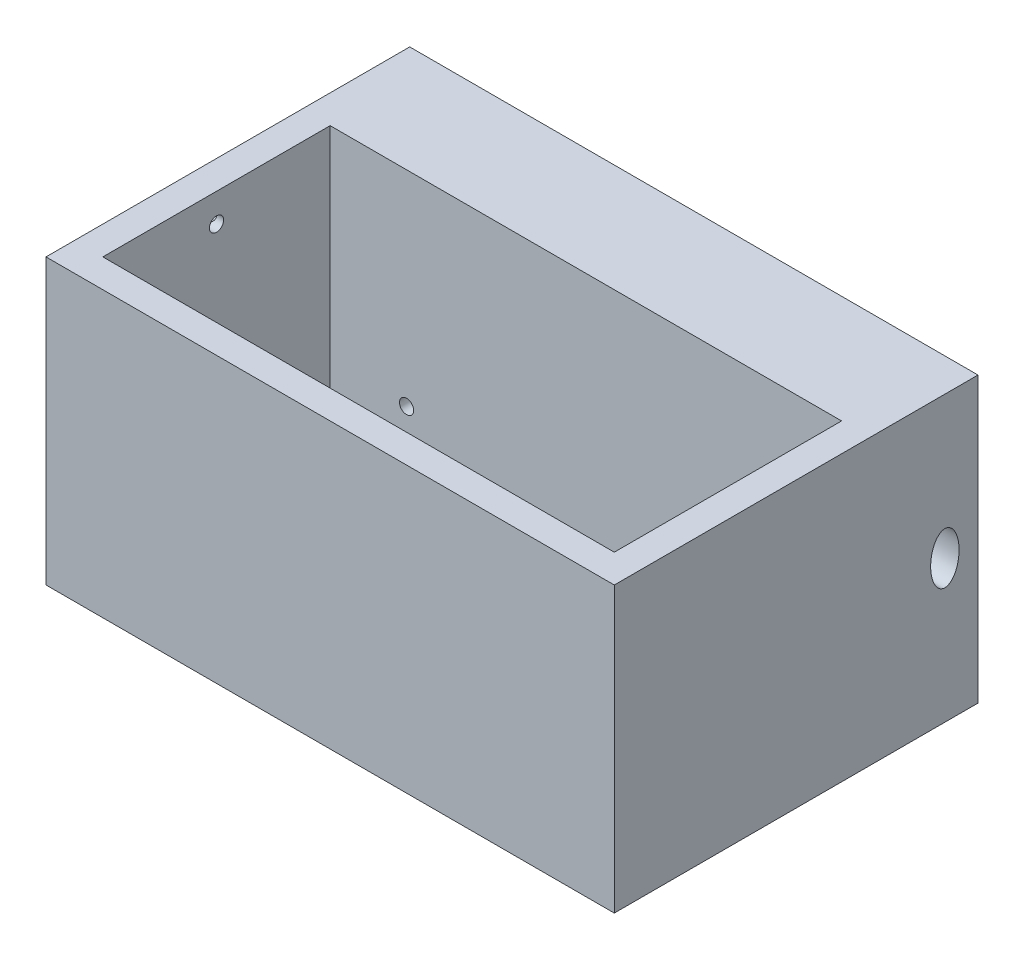
ISO-10303-21;
HEADER;
FILE_DESCRIPTION(('STEP AP214'),'2;1');
FILE_NAME('part.step','',(''),(''),'','','');
FILE_SCHEMA(('AUTOMOTIVE_DESIGN { 1 0 10303 214 1 1 1 1 }'));
ENDSEC;
DATA;
#1=APPLICATION_CONTEXT('core data for automotive mechanical design processes');
#2=APPLICATION_PROTOCOL_DEFINITION('international standard','automotive_design',2000,#1);
#3=PRODUCT_CONTEXT('',#1,'mechanical');
#4=PRODUCT('Part','Part','',(#3));
#5=PRODUCT_RELATED_PRODUCT_CATEGORY('part','',(#4));
#6=PRODUCT_DEFINITION_FORMATION('','',#4);
#7=PRODUCT_DEFINITION_CONTEXT('part definition',#1,'design');
#8=PRODUCT_DEFINITION('design','',#6,#7);
#9=PRODUCT_DEFINITION_SHAPE('','',#8);
#10=(LENGTH_UNIT() NAMED_UNIT(*) SI_UNIT(.MILLI.,.METRE.));
#11=(NAMED_UNIT(*) PLANE_ANGLE_UNIT() SI_UNIT($,.RADIAN.));
#12=(NAMED_UNIT(*) SI_UNIT($,.STERADIAN.) SOLID_ANGLE_UNIT());
#13=UNCERTAINTY_MEASURE_WITH_UNIT(LENGTH_MEASURE(1.E-05),#10,'distance_accuracy_value','');
#14=(GEOMETRIC_REPRESENTATION_CONTEXT(3) GLOBAL_UNCERTAINTY_ASSIGNED_CONTEXT((#13)) GLOBAL_UNIT_ASSIGNED_CONTEXT((#10,
#11,#12)) REPRESENTATION_CONTEXT('',''));
#15=CARTESIAN_POINT('',(0.,0.,0.));
#16=DIRECTION('',(0.,0.,1.));
#17=DIRECTION('',(1.,0.,0.));
#18=AXIS2_PLACEMENT_3D('',#15,#16,#17);
#19=CARTESIAN_POINT('',(-31.5504524503073,8.33548406117359,-16.4644660940673));
#20=DIRECTION('',(0.,0.,-1.));
#21=DIRECTION('',(-1.,0.,0.));
#22=AXIS2_PLACEMENT_3D('',#19,#20,#21);
#23=CYLINDRICAL_SURFACE('',#22,1.25);
#24=CARTESIAN_POINT('',(-31.5504524503073,8.33548406117359,-20.));
#25=DIRECTION('',(0.,0.,1.));
#26=DIRECTION('',(1.,0.,0.));
#27=AXIS2_PLACEMENT_3D('',#24,#25,#26);
#28=CIRCLE('',#27,1.25);
#29=CARTESIAN_POINT('',(-30.3004524503073,8.33548406117359,-20.));
#30=VERTEX_POINT('',#29);
#31=EDGE_CURVE('E193',#30,#30,#28,.F.);
#32=ORIENTED_EDGE('',*,*,#31,.F.);
#33=EDGE_LOOP('',(#32));
#34=FACE_BOUND('',#33,.T.);
#35=CARTESIAN_POINT('',(-31.5504524503073,8.33548406117359,-22.5));
#36=DIRECTION('',(0.,0.,-1.));
#37=DIRECTION('',(-1.,0.,0.));
#38=AXIS2_PLACEMENT_3D('',#35,#36,#37);
#39=CIRCLE('',#38,1.25);
#40=CARTESIAN_POINT('',(-32.8004524503073,8.33548406117359,-22.5));
#41=VERTEX_POINT('',#40);
#42=EDGE_CURVE('E191',#41,#41,#39,.F.);
#43=ORIENTED_EDGE('',*,*,#42,.F.);
#44=EDGE_LOOP('',(#43));
#45=FACE_BOUND('',#44,.T.);
#46=ADVANCED_FACE('F39',(#34,#45),#23,.F.);
#47=CARTESIAN_POINT('',(48.975,45.,22.5));
#48=DIRECTION('',(-1.,0.,0.));
#49=DIRECTION('',(0.,0.,1.));
#50=AXIS2_PLACEMENT_3D('',#47,#48,#49);
#51=CYLINDRICAL_SURFACE('',#50,1.25);
#52=CARTESIAN_POINT('',(1.24999999999999,45.,22.5));
#53=DIRECTION('',(-0.707106781186547,0.707106781186547,0.));
#54=DIRECTION('',(-0.707106781186547,-0.707106781186547,0.));
#55=AXIS2_PLACEMENT_3D('',#52,#53,#54);
#56=ELLIPSE('',#55,1.76776695296637,1.25);
#57=CARTESIAN_POINT('',(1.24999999999999,45.,21.25));
#58=VERTEX_POINT('',#57);
#59=CARTESIAN_POINT('',(1.24999999999999,45.,23.75));
#60=VERTEX_POINT('',#59);
#61=EDGE_CURVE('E11',#58,#60,#56,.F.);
#62=ORIENTED_EDGE('',*,*,#61,.F.);
#63=CARTESIAN_POINT('',(1.24999999999999,45.,22.5));
#64=DIRECTION('',(-0.707106781186547,-0.707106781186547,0.));
#65=DIRECTION('',(-0.707106781186547,0.707106781186547,0.));
#66=AXIS2_PLACEMENT_3D('',#63,#64,#65);
#67=ELLIPSE('',#66,1.76776695296637,1.25);
#68=EDGE_CURVE('E55',#60,#58,#67,.F.);
#69=ORIENTED_EDGE('',*,*,#68,.F.);
#70=EDGE_LOOP('',(#62,#69));
#71=FACE_BOUND('',#70,.T.);
#72=CARTESIAN_POINT('',(47.5,45.,22.5));
#73=DIRECTION('',(-0.707106781186547,0.,0.707106781186548));
#74=DIRECTION('',(0.707106781186548,0.,0.707106781186547));
#75=AXIS2_PLACEMENT_3D('',#72,#73,#74);
#76=ELLIPSE('',#75,1.76776695296637,1.25);
#77=CARTESIAN_POINT('',(48.75,45.,23.75));
#78=VERTEX_POINT('',#77);
#79=EDGE_CURVE('E273',#78,#78,#76,.T.);
#80=ORIENTED_EDGE('',*,*,#79,.F.);
#81=EDGE_LOOP('',(#80));
#82=FACE_BOUND('',#81,.T.);
#83=ADVANCED_FACE('F329',(#71,#82),#51,.F.);
#84=CARTESIAN_POINT('',(0.,50.,0.));
#85=DIRECTION('',(0.,-1.,0.));
#86=DIRECTION('',(0.,0.,-1.));
#87=AXIS2_PLACEMENT_3D('',#84,#85,#86);
#88=PLANE('',#87);
#89=DIRECTION('',(0.,0.,-1.));
#90=VECTOR('',#89,1.);
#91=CARTESIAN_POINT('',(50.,50.,25.));
#92=LINE('',#91,#90);
#93=CARTESIAN_POINT('',(50.,50.,25.));
#94=VERTEX_POINT('',#93);
#95=CARTESIAN_POINT('',(50.,50.,-39.));
#96=VERTEX_POINT('',#95);
#97=EDGE_CURVE('E305',#94,#96,#92,.T.);
#98=ORIENTED_EDGE('',*,*,#97,.T.);
#99=DIRECTION('',(1.,0.,0.));
#100=VECTOR('',#99,1.);
#101=CARTESIAN_POINT('',(0.,50.,-39.));
#102=LINE('',#101,#100);
#103=CARTESIAN_POINT('',(-50.,50.,-39.));
#104=VERTEX_POINT('',#103);
#105=EDGE_CURVE('E228',#104,#96,#102,.T.);
#106=ORIENTED_EDGE('',*,*,#105,.F.);
#107=DIRECTION('',(0.,0.,1.));
#108=VECTOR('',#107,1.);
#109=CARTESIAN_POINT('',(-50.,50.,25.));
#110=LINE('',#109,#108);
#111=CARTESIAN_POINT('',(-50.,50.,25.));
#112=VERTEX_POINT('',#111);
#113=EDGE_CURVE('E307',#104,#112,#110,.T.);
#114=ORIENTED_EDGE('',*,*,#113,.T.);
#115=DIRECTION('',(1.,0.,0.));
#116=VECTOR('',#115,1.);
#117=CARTESIAN_POINT('',(-50.,50.,25.));
#118=LINE('',#117,#116);
#119=EDGE_CURVE('E310',#112,#94,#118,.T.);
#120=ORIENTED_EDGE('',*,*,#119,.T.);
#121=EDGE_LOOP('',(#98,#106,#114,#120));
#122=FACE_BOUND('',#121,.T.);
#123=DIRECTION('',(0.,0.,-1.));
#124=VECTOR('',#123,1.);
#125=CARTESIAN_POINT('',(45.,50.,0.));
#126=LINE('',#125,#124);
#127=CARTESIAN_POINT('',(45.,50.,20.));
#128=VERTEX_POINT('',#127);
#129=CARTESIAN_POINT('',(45.,50.,-20.));
#130=VERTEX_POINT('',#129);
#131=EDGE_CURVE('E298',#128,#130,#126,.T.);
#132=ORIENTED_EDGE('',*,*,#131,.F.);
#133=DIRECTION('',(1.,0.,0.));
#134=VECTOR('',#133,1.);
#135=CARTESIAN_POINT('',(0.,50.,20.));
#136=LINE('',#135,#134);
#137=CARTESIAN_POINT('',(-45.,50.,20.));
#138=VERTEX_POINT('',#137);
#139=EDGE_CURVE('E289',#138,#128,#136,.T.);
#140=ORIENTED_EDGE('',*,*,#139,.F.);
#141=DIRECTION('',(0.,0.,1.));
#142=VECTOR('',#141,1.);
#143=CARTESIAN_POINT('',(-45.,50.,0.));
#144=LINE('',#143,#142);
#145=CARTESIAN_POINT('',(-45.,50.,-20.));
#146=VERTEX_POINT('',#145);
#147=EDGE_CURVE('E302',#146,#138,#144,.T.);
#148=ORIENTED_EDGE('',*,*,#147,.F.);
#149=DIRECTION('',(-1.,0.,0.));
#150=VECTOR('',#149,1.);
#151=CARTESIAN_POINT('',(0.,50.,-20.));
#152=LINE('',#151,#150);
#153=EDGE_CURVE('E300',#130,#146,#152,.T.);
#154=ORIENTED_EDGE('',*,*,#153,.F.);
#155=EDGE_LOOP('',(#132,#140,#148,#154));
#156=FACE_BOUND('',#155,.T.);
#157=ADVANCED_FACE('F337',(#122,#156),#88,.F.);
#158=CARTESIAN_POINT('',(50.,50.,25.));
#159=DIRECTION('',(-1.,0.,0.));
#160=DIRECTION('',(0.,0.,1.));
#161=AXIS2_PLACEMENT_3D('',#158,#159,#160);
#162=PLANE('',#161);
#163=CARTESIAN_POINT('',(50.,25.,-33.1692262033763));
#164=DIRECTION('',(1.,0.,0.));
#165=DIRECTION('',(0.,1.,0.));
#166=AXIS2_PLACEMENT_3D('',#163,#164,#165);
#167=ELLIPSE('',#166,4.5,2.5);
#168=CARTESIAN_POINT('',(50.,29.5,-33.1692262033763));
#169=VERTEX_POINT('',#168);
#170=EDGE_CURVE('E532',#169,#169,#167,.T.);
#171=ORIENTED_EDGE('',*,*,#170,.F.);
#172=EDGE_LOOP('',(#171));
#173=FACE_BOUND('',#172,.T.);
#174=DIRECTION('',(0.,0.,-1.));
#175=VECTOR('',#174,1.);
#176=CARTESIAN_POINT('',(50.,0.,25.));
#177=LINE('',#176,#175);
#178=CARTESIAN_POINT('',(50.,0.,25.));
#179=VERTEX_POINT('',#178);
#180=CARTESIAN_POINT('',(50.,0.,-39.));
#181=VERTEX_POINT('',#180);
#182=EDGE_CURVE('E284',#179,#181,#177,.T.);
#183=ORIENTED_EDGE('',*,*,#182,.T.);
#184=DIRECTION('',(0.,-1.,0.));
#185=VECTOR('',#184,1.);
#186=CARTESIAN_POINT('',(50.,0.,-39.));
#187=LINE('',#186,#185);
#188=EDGE_CURVE('E231',#96,#181,#187,.T.);
#189=ORIENTED_EDGE('',*,*,#188,.F.);
#190=ORIENTED_EDGE('',*,*,#97,.F.);
#191=DIRECTION('',(0.,-1.,0.));
#192=VECTOR('',#191,1.);
#193=CARTESIAN_POINT('',(50.,50.,25.));
#194=LINE('',#193,#192);
#195=EDGE_CURVE('E312',#94,#179,#194,.T.);
#196=ORIENTED_EDGE('',*,*,#195,.T.);
#197=EDGE_LOOP('',(#183,#189,#190,#196));
#198=FACE_BOUND('',#197,.T.);
#199=ADVANCED_FACE('F41',(#173,#198),#162,.F.);
#200=CARTESIAN_POINT('',(-50.,50.,25.));
#201=DIRECTION('',(1.,0.,0.));
#202=DIRECTION('',(0.,0.,-1.));
#203=AXIS2_PLACEMENT_3D('',#200,#201,#202);
#204=PLANE('',#203);
#205=CARTESIAN_POINT('',(-50.,8.33548406117359,-15.8565067648138));
#206=DIRECTION('',(-1.,0.,0.));
#207=DIRECTION('',(0.,0.,1.));
#208=AXIS2_PLACEMENT_3D('',#205,#206,#207);
#209=CIRCLE('',#208,1.25);
#210=CARTESIAN_POINT('',(-50.,8.33548406117359,-14.6065067648138));
#211=VERTEX_POINT('',#210);
#212=EDGE_CURVE('E496',#211,#211,#209,.T.);
#213=ORIENTED_EDGE('',*,*,#212,.F.);
#214=EDGE_LOOP('',(#213));
#215=FACE_BOUND('',#214,.T.);
#216=DIRECTION('',(0.,0.,1.));
#217=VECTOR('',#216,1.);
#218=CARTESIAN_POINT('',(-50.,0.,25.));
#219=LINE('',#218,#217);
#220=CARTESIAN_POINT('',(-50.,0.,-39.));
#221=VERTEX_POINT('',#220);
#222=CARTESIAN_POINT('',(-50.,0.,25.));
#223=VERTEX_POINT('',#222);
#224=EDGE_CURVE('E314',#221,#223,#219,.T.);
#225=ORIENTED_EDGE('',*,*,#224,.T.);
#226=DIRECTION('',(0.,-1.,0.));
#227=VECTOR('',#226,1.);
#228=CARTESIAN_POINT('',(-50.,50.,25.));
#229=LINE('',#228,#227);
#230=EDGE_CURVE('E319',#112,#223,#229,.T.);
#231=ORIENTED_EDGE('',*,*,#230,.F.);
#232=ORIENTED_EDGE('',*,*,#113,.F.);
#233=DIRECTION('',(0.,1.,0.));
#234=VECTOR('',#233,1.);
#235=CARTESIAN_POINT('',(-50.,0.,-39.));
#236=LINE('',#235,#234);
#237=EDGE_CURVE('E224',#221,#104,#236,.T.);
#238=ORIENTED_EDGE('',*,*,#237,.F.);
#239=EDGE_LOOP('',(#225,#231,#232,#238));
#240=FACE_BOUND('',#239,.T.);
#241=ADVANCED_FACE('F454',(#215,#240),#204,.F.);
#242=CARTESIAN_POINT('',(-50.,50.,25.));
#243=DIRECTION('',(0.,0.,-1.));
#244=DIRECTION('',(-1.,0.,0.));
#245=AXIS2_PLACEMENT_3D('',#242,#243,#244);
#246=PLANE('',#245);
#247=DIRECTION('',(1.,0.,0.));
#248=VECTOR('',#247,1.);
#249=CARTESIAN_POINT('',(-50.,0.,25.));
#250=LINE('',#249,#248);
#251=EDGE_CURVE('E308',#223,#179,#250,.T.);
#252=ORIENTED_EDGE('',*,*,#251,.T.);
#253=ORIENTED_EDGE('',*,*,#195,.F.);
#254=ORIENTED_EDGE('',*,*,#119,.F.);
#255=ORIENTED_EDGE('',*,*,#230,.T.);
#256=EDGE_LOOP('',(#252,#253,#254,#255));
#257=FACE_BOUND('',#256,.T.);
#258=ADVANCED_FACE('F450',(#257),#246,.F.);
#259=CARTESIAN_POINT('',(0.,0.,0.));
#260=DIRECTION('',(0.,-1.,0.));
#261=DIRECTION('',(0.,0.,-1.));
#262=AXIS2_PLACEMENT_3D('',#259,#260,#261);
#263=PLANE('',#262);
#264=CARTESIAN_POINT('',(1.24999999999999,0.,22.5));
#265=DIRECTION('',(0.,-1.,0.));
#266=DIRECTION('',(0.,0.,-1.));
#267=AXIS2_PLACEMENT_3D('',#264,#265,#266);
#268=CIRCLE('',#267,1.25);
#269=CARTESIAN_POINT('',(1.24999999999999,0.,21.25));
#270=VERTEX_POINT('',#269);
#271=EDGE_CURVE('E253',#270,#270,#268,.T.);
#272=ORIENTED_EDGE('',*,*,#271,.F.);
#273=EDGE_LOOP('',(#272));
#274=FACE_BOUND('',#273,.T.);
#275=ORIENTED_EDGE('',*,*,#182,.F.);
#276=ORIENTED_EDGE('',*,*,#251,.F.);
#277=ORIENTED_EDGE('',*,*,#224,.F.);
#278=DIRECTION('',(-1.,0.,0.));
#279=VECTOR('',#278,1.);
#280=CARTESIAN_POINT('',(0.,0.,-39.));
#281=LINE('',#280,#279);
#282=EDGE_CURVE('E221',#181,#221,#281,.T.);
#283=ORIENTED_EDGE('',*,*,#282,.F.);
#284=EDGE_LOOP('',(#275,#276,#277,#283));
#285=FACE_BOUND('',#284,.T.);
#286=ADVANCED_FACE('F430',(#274,#285),#263,.T.);
#287=CARTESIAN_POINT('',(45.,50.,25.));
#288=DIRECTION('',(-1.,0.,0.));
#289=DIRECTION('',(0.,0.,1.));
#290=AXIS2_PLACEMENT_3D('',#287,#288,#289);
#291=PLANE('',#290);
#292=DIRECTION('',(0.,0.,-1.));
#293=VECTOR('',#292,1.);
#294=CARTESIAN_POINT('',(45.,5.,0.));
#295=LINE('',#294,#293);
#296=CARTESIAN_POINT('',(45.,5.,20.));
#297=VERTEX_POINT('',#296);
#298=CARTESIAN_POINT('',(45.,5.,-20.));
#299=VERTEX_POINT('',#298);
#300=EDGE_CURVE('E267',#297,#299,#295,.T.);
#301=ORIENTED_EDGE('',*,*,#300,.F.);
#302=DIRECTION('',(0.,-1.,0.));
#303=VECTOR('',#302,1.);
#304=CARTESIAN_POINT('',(45.,50.,20.));
#305=LINE('',#304,#303);
#306=EDGE_CURVE('E286',#128,#297,#305,.T.);
#307=ORIENTED_EDGE('',*,*,#306,.F.);
#308=ORIENTED_EDGE('',*,*,#131,.T.);
#309=DIRECTION('',(0.,-1.,0.));
#310=VECTOR('',#309,1.);
#311=CARTESIAN_POINT('',(45.,50.,-20.));
#312=LINE('',#311,#310);
#313=EDGE_CURVE('E281',#130,#299,#312,.T.);
#314=ORIENTED_EDGE('',*,*,#313,.T.);
#315=EDGE_LOOP('',(#301,#307,#308,#314));
#316=FACE_BOUND('',#315,.T.);
#317=ADVANCED_FACE('F426',(#316),#291,.T.);
#318=CARTESIAN_POINT('',(-50.,50.,-20.));
#319=DIRECTION('',(0.,0.,1.));
#320=DIRECTION('',(1.,0.,0.));
#321=AXIS2_PLACEMENT_3D('',#318,#319,#320);
#322=PLANE('',#321);
#323=CARTESIAN_POINT('',(-31.5504524503073,13.9354840611736,-20.));
#324=DIRECTION('',(0.,0.,1.));
#325=DIRECTION('',(1.,0.,0.));
#326=AXIS2_PLACEMENT_3D('',#323,#324,#325);
#327=CIRCLE('',#326,1.25);
#328=CARTESIAN_POINT('',(-30.3004524503073,13.9354840611736,-20.));
#329=VERTEX_POINT('',#328);
#330=EDGE_CURVE('E183',#329,#329,#327,.F.);
#331=ORIENTED_EDGE('',*,*,#330,.T.);
#332=EDGE_LOOP('',(#331));
#333=FACE_BOUND('',#332,.T.);
#334=ORIENTED_EDGE('',*,*,#31,.T.);
#335=EDGE_LOOP('',(#334));
#336=FACE_BOUND('',#335,.T.);
#337=DIRECTION('',(-1.,0.,0.));
#338=VECTOR('',#337,1.);
#339=CARTESIAN_POINT('',(0.,5.,-20.));
#340=LINE('',#339,#338);
#341=CARTESIAN_POINT('',(-45.,5.,-20.));
#342=VERTEX_POINT('',#341);
#343=EDGE_CURVE('E280',#299,#342,#340,.T.);
#344=ORIENTED_EDGE('',*,*,#343,.F.);
#345=ORIENTED_EDGE('',*,*,#313,.F.);
#346=ORIENTED_EDGE('',*,*,#153,.T.);
#347=DIRECTION('',(0.,-1.,0.));
#348=VECTOR('',#347,1.);
#349=CARTESIAN_POINT('',(-45.,50.,-20.));
#350=LINE('',#349,#348);
#351=EDGE_CURVE('E285',#146,#342,#350,.T.);
#352=ORIENTED_EDGE('',*,*,#351,.T.);
#353=EDGE_LOOP('',(#344,#345,#346,#352));
#354=FACE_BOUND('',#353,.T.);
#355=ADVANCED_FACE('F429',(#333,#336,#354),#322,.T.);
#356=CARTESIAN_POINT('',(-45.,50.,25.));
#357=DIRECTION('',(1.,0.,0.));
#358=DIRECTION('',(0.,0.,-1.));
#359=AXIS2_PLACEMENT_3D('',#356,#357,#358);
#360=PLANE('',#359);
#361=CARTESIAN_POINT('',(-45.,8.33548406117359,-15.8565067648138));
#362=DIRECTION('',(1.,0.,0.));
#363=DIRECTION('',(0.,0.,-1.));
#364=AXIS2_PLACEMENT_3D('',#361,#362,#363);
#365=CIRCLE('',#364,1.25);
#366=CARTESIAN_POINT('',(-45.,8.33548406117359,-17.1065067648138));
#367=VERTEX_POINT('',#366);
#368=EDGE_CURVE('E498',#367,#367,#365,.F.);
#369=ORIENTED_EDGE('',*,*,#368,.T.);
#370=EDGE_LOOP('',(#369));
#371=FACE_BOUND('',#370,.T.);
#372=CARTESIAN_POINT('',(-45.,45.,0.));
#373=DIRECTION('',(1.,0.,0.));
#374=DIRECTION('',(0.,0.,-1.));
#375=AXIS2_PLACEMENT_3D('',#372,#373,#374);
#376=CIRCLE('',#375,1.25);
#377=CARTESIAN_POINT('',(-45.,45.,-1.25));
#378=VERTEX_POINT('',#377);
#379=EDGE_CURVE('E260',#378,#378,#376,.T.);
#380=ORIENTED_EDGE('',*,*,#379,.F.);
#381=EDGE_LOOP('',(#380));
#382=FACE_BOUND('',#381,.T.);
#383=DIRECTION('',(0.,0.,1.));
#384=VECTOR('',#383,1.);
#385=CARTESIAN_POINT('',(-45.,5.,0.));
#386=LINE('',#385,#384);
#387=CARTESIAN_POINT('',(-45.,5.,20.));
#388=VERTEX_POINT('',#387);
#389=EDGE_CURVE('E291',#342,#388,#386,.T.);
#390=ORIENTED_EDGE('',*,*,#389,.F.);
#391=ORIENTED_EDGE('',*,*,#351,.F.);
#392=ORIENTED_EDGE('',*,*,#147,.T.);
#393=DIRECTION('',(0.,-1.,0.));
#394=VECTOR('',#393,1.);
#395=CARTESIAN_POINT('',(-45.,50.,20.));
#396=LINE('',#395,#394);
#397=EDGE_CURVE('E63',#138,#388,#396,.T.);
#398=ORIENTED_EDGE('',*,*,#397,.T.);
#399=EDGE_LOOP('',(#390,#391,#392,#398));
#400=FACE_BOUND('',#399,.T.);
#401=ADVANCED_FACE('F434',(#371,#382,#400),#360,.T.);
#402=CARTESIAN_POINT('',(-50.,50.,20.));
#403=DIRECTION('',(0.,0.,-1.));
#404=DIRECTION('',(-1.,0.,0.));
#405=AXIS2_PLACEMENT_3D('',#402,#403,#404);
#406=PLANE('',#405);
#407=DIRECTION('',(1.,0.,0.));
#408=VECTOR('',#407,1.);
#409=CARTESIAN_POINT('',(0.,5.,20.));
#410=LINE('',#409,#408);
#411=EDGE_CURVE('E295',#388,#297,#410,.T.);
#412=ORIENTED_EDGE('',*,*,#411,.F.);
#413=ORIENTED_EDGE('',*,*,#397,.F.);
#414=ORIENTED_EDGE('',*,*,#139,.T.);
#415=ORIENTED_EDGE('',*,*,#306,.T.);
#416=EDGE_LOOP('',(#412,#413,#414,#415));
#417=FACE_BOUND('',#416,.T.);
#418=ADVANCED_FACE('F438',(#417),#406,.T.);
#419=CARTESIAN_POINT('',(0.,5.,0.));
#420=DIRECTION('',(0.,-1.,0.));
#421=DIRECTION('',(0.,0.,-1.));
#422=AXIS2_PLACEMENT_3D('',#419,#420,#421);
#423=PLANE('',#422);
#424=ORIENTED_EDGE('',*,*,#300,.T.);
#425=ORIENTED_EDGE('',*,*,#343,.T.);
#426=ORIENTED_EDGE('',*,*,#389,.T.);
#427=ORIENTED_EDGE('',*,*,#411,.T.);
#428=EDGE_LOOP('',(#424,#425,#426,#427));
#429=FACE_BOUND('',#428,.T.);
#430=ADVANCED_FACE('F408',(#429),#423,.F.);
#431=CARTESIAN_POINT('',(47.5,45.,-23.975));
#432=DIRECTION('',(0.,0.,1.));
#433=DIRECTION('',(1.,0.,0.));
#434=AXIS2_PLACEMENT_3D('',#431,#432,#433);
#435=CYLINDRICAL_SURFACE('',#434,1.25);
#436=CARTESIAN_POINT('',(47.5,45.,-22.5));
#437=DIRECTION('',(0.707106781186548,0.,0.707106781186548));
#438=DIRECTION('',(0.707106781186548,0.,-0.707106781186548));
#439=AXIS2_PLACEMENT_3D('',#436,#437,#438);
#440=ELLIPSE('',#439,1.76776695296637,1.25);
#441=CARTESIAN_POINT('',(48.75,45.,-23.75));
#442=VERTEX_POINT('',#441);
#443=EDGE_CURVE('E270',#442,#442,#440,.T.);
#444=ORIENTED_EDGE('',*,*,#443,.F.);
#445=EDGE_LOOP('',(#444));
#446=FACE_BOUND('',#445,.T.);
#447=ORIENTED_EDGE('',*,*,#79,.T.);
#448=EDGE_LOOP('',(#447));
#449=FACE_BOUND('',#448,.T.);
#450=ADVANCED_FACE('F415',(#446,#449),#435,.F.);
#451=CARTESIAN_POINT('',(-48.975,45.,-22.5));
#452=DIRECTION('',(1.,0.,0.));
#453=DIRECTION('',(0.,0.,-1.));
#454=AXIS2_PLACEMENT_3D('',#451,#452,#453);
#455=CYLINDRICAL_SURFACE('',#454,1.25);
#456=CARTESIAN_POINT('',(-47.5,45.,-22.5));
#457=DIRECTION('',(0.707106781186548,0.,-0.707106781186548));
#458=DIRECTION('',(-0.707106781186548,0.,-0.707106781186548));
#459=AXIS2_PLACEMENT_3D('',#456,#457,#458);
#460=ELLIPSE('',#459,1.76776695296637,1.25);
#461=CARTESIAN_POINT('',(-48.75,45.,-23.75));
#462=VERTEX_POINT('',#461);
#463=EDGE_CURVE('E264',#462,#462,#460,.T.);
#464=ORIENTED_EDGE('',*,*,#463,.F.);
#465=EDGE_LOOP('',(#464));
#466=FACE_BOUND('',#465,.T.);
#467=ORIENTED_EDGE('',*,*,#443,.T.);
#468=EDGE_LOOP('',(#467));
#469=FACE_BOUND('',#468,.T.);
#470=ADVANCED_FACE('F411',(#466,#469),#455,.F.);
#471=CARTESIAN_POINT('',(-47.5,45.,1.47500000000001));
#472=DIRECTION('',(0.,0.,-1.));
#473=DIRECTION('',(-1.,0.,0.));
#474=AXIS2_PLACEMENT_3D('',#471,#472,#473);
#475=CYLINDRICAL_SURFACE('',#474,1.25);
#476=CARTESIAN_POINT('',(-47.5,45.,0.));
#477=DIRECTION('',(-0.707106781186548,0.,-0.707106781186547));
#478=DIRECTION('',(-0.707106781186547,0.,0.707106781186548));
#479=AXIS2_PLACEMENT_3D('',#476,#477,#478);
#480=ELLIPSE('',#479,1.76776695296637,1.25);
#481=CARTESIAN_POINT('',(-48.75,45.,1.25));
#482=VERTEX_POINT('',#481);
#483=EDGE_CURVE('E263',#482,#482,#480,.T.);
#484=ORIENTED_EDGE('',*,*,#483,.F.);
#485=EDGE_LOOP('',(#484));
#486=FACE_BOUND('',#485,.T.);
#487=ORIENTED_EDGE('',*,*,#463,.T.);
#488=EDGE_LOOP('',(#487));
#489=FACE_BOUND('',#488,.T.);
#490=ADVANCED_FACE('F406',(#486,#489),#475,.F.);
#491=CARTESIAN_POINT('',(-45.,45.,0.));
#492=DIRECTION('',(-1.,0.,0.));
#493=DIRECTION('',(0.,0.,1.));
#494=AXIS2_PLACEMENT_3D('',#491,#492,#493);
#495=CYLINDRICAL_SURFACE('',#494,1.25);
#496=ORIENTED_EDGE('',*,*,#379,.T.);
#497=EDGE_LOOP('',(#496));
#498=FACE_BOUND('',#497,.T.);
#499=ORIENTED_EDGE('',*,*,#483,.T.);
#500=EDGE_LOOP('',(#499));
#501=FACE_BOUND('',#500,.T.);
#502=ADVANCED_FACE('F403',(#498,#501),#495,.F.);
#503=CARTESIAN_POINT('',(1.24999999999999,5.,22.5));
#504=DIRECTION('',(0.,1.,0.));
#505=DIRECTION('',(0.,0.,1.));
#506=AXIS2_PLACEMENT_3D('',#503,#504,#505);
#507=CYLINDRICAL_SURFACE('',#506,1.25);
#508=CARTESIAN_POINT('',(1.24999999999999,45.,22.5));
#509=DIRECTION('',(-0.707106781186547,0.707106781186547,0.));
#510=DIRECTION('',(-0.707106781186547,-0.707106781186547,0.));
#511=AXIS2_PLACEMENT_3D('',#508,#509,#510);
#512=ELLIPSE('',#511,1.76776695296637,1.25);
#513=EDGE_CURVE('E48',#58,#60,#512,.T.);
#514=ORIENTED_EDGE('',*,*,#513,.T.);
#515=ORIENTED_EDGE('',*,*,#68,.T.);
#516=EDGE_LOOP('',(#514,#515));
#517=FACE_BOUND('',#516,.T.);
#518=ORIENTED_EDGE('',*,*,#271,.T.);
#519=EDGE_LOOP('',(#518));
#520=FACE_BOUND('',#519,.T.);
#521=ADVANCED_FACE('F399',(#517,#520),#507,.F.);
#522=CARTESIAN_POINT('',(-3.74999999999998,45.,22.5));
#523=DIRECTION('',(1.,0.,0.));
#524=DIRECTION('',(0.,0.,-1.));
#525=AXIS2_PLACEMENT_3D('',#522,#523,#524);
#526=PLANE('',#525);
#527=CARTESIAN_POINT('',(-3.74999999999998,45.,22.5));
#528=DIRECTION('',(1.,0.,0.));
#529=DIRECTION('',(0.,0.,-1.));
#530=AXIS2_PLACEMENT_3D('',#527,#528,#529);
#531=CIRCLE('',#530,1.25);
#532=CARTESIAN_POINT('',(-3.74999999999998,45.,21.25));
#533=VERTEX_POINT('',#532);
#534=EDGE_CURVE('E259',#533,#533,#531,.T.);
#535=ORIENTED_EDGE('',*,*,#534,.T.);
#536=EDGE_LOOP('',(#535));
#537=FACE_BOUND('',#536,.T.);
#538=ADVANCED_FACE('F421',(#537),#526,.T.);
#539=ORIENTED_EDGE('',*,*,#513,.F.);
#540=CARTESIAN_POINT('',(1.24999999999999,45.,22.5));
#541=DIRECTION('',(-0.707106781186547,-0.707106781186547,0.));
#542=DIRECTION('',(-0.707106781186547,0.707106781186547,0.));
#543=AXIS2_PLACEMENT_3D('',#540,#541,#542);
#544=ELLIPSE('',#543,1.76776695296637,1.25);
#545=EDGE_CURVE('E323',#60,#58,#544,.T.);
#546=ORIENTED_EDGE('',*,*,#545,.F.);
#547=EDGE_LOOP('',(#539,#546));
#548=FACE_BOUND('',#547,.T.);
#549=ORIENTED_EDGE('',*,*,#534,.F.);
#550=EDGE_LOOP('',(#549));
#551=FACE_BOUND('',#550,.T.);
#552=ADVANCED_FACE('F339',(#548,#551),#51,.F.);
#553=CARTESIAN_POINT('',(1.24999999999999,47.5,22.5));
#554=DIRECTION('',(0.,1.,0.));
#555=DIRECTION('',(0.,0.,1.));
#556=AXIS2_PLACEMENT_3D('',#553,#554,#555);
#557=PLANE('',#556);
#558=CARTESIAN_POINT('',(1.24999999999999,47.5,22.5));
#559=DIRECTION('',(0.,1.,0.));
#560=DIRECTION('',(0.,0.,1.));
#561=AXIS2_PLACEMENT_3D('',#558,#559,#560);
#562=CIRCLE('',#561,1.25);
#563=CARTESIAN_POINT('',(1.24999999999999,47.5,23.75));
#564=VERTEX_POINT('',#563);
#565=EDGE_CURVE('E256',#564,#564,#562,.T.);
#566=ORIENTED_EDGE('',*,*,#565,.F.);
#567=EDGE_LOOP('',(#566));
#568=FACE_BOUND('',#567,.T.);
#569=ADVANCED_FACE('F395',(#568),#557,.F.);
#570=ORIENTED_EDGE('',*,*,#61,.T.);
#571=ORIENTED_EDGE('',*,*,#545,.T.);
#572=EDGE_LOOP('',(#570,#571));
#573=FACE_BOUND('',#572,.T.);
#574=ORIENTED_EDGE('',*,*,#565,.T.);
#575=EDGE_LOOP('',(#574));
#576=FACE_BOUND('',#575,.T.);
#577=ADVANCED_FACE('F393',(#573,#576),#507,.F.);
#578=CARTESIAN_POINT('',(45.,0.,-39.));
#579=DIRECTION('',(-1.,0.,0.));
#580=DIRECTION('',(0.,-1.,0.));
#581=AXIS2_PLACEMENT_3D('',#578,#579,#580);
#582=PLANE('',#581);
#583=CARTESIAN_POINT('',(45.,25.,-33.1692262033763));
#584=DIRECTION('',(1.,0.,0.));
#585=DIRECTION('',(0.,1.,0.));
#586=AXIS2_PLACEMENT_3D('',#583,#584,#585);
#587=ELLIPSE('',#586,4.5,2.5);
#588=CARTESIAN_POINT('',(45.,29.5,-33.1692262033763));
#589=VERTEX_POINT('',#588);
#590=EDGE_CURVE('E494',#589,#589,#587,.T.);
#591=ORIENTED_EDGE('',*,*,#590,.T.);
#592=EDGE_LOOP('',(#591));
#593=FACE_BOUND('',#592,.T.);
#594=DIRECTION('',(0.,-1.,0.));
#595=VECTOR('',#594,1.);
#596=CARTESIAN_POINT('',(45.,0.,-25.));
#597=LINE('',#596,#595);
#598=CARTESIAN_POINT('',(45.,45.,-25.));
#599=VERTEX_POINT('',#598);
#600=CARTESIAN_POINT('',(45.,26.894573737825,-25.));
#601=VERTEX_POINT('',#600);
#602=EDGE_CURVE('E218',#599,#601,#597,.T.);
#603=ORIENTED_EDGE('',*,*,#602,.F.);
#604=DIRECTION('',(0.,0.,1.));
#605=VECTOR('',#604,1.);
#606=CARTESIAN_POINT('',(45.,45.,-39.));
#607=LINE('',#606,#605);
#608=CARTESIAN_POINT('',(45.,45.,-39.));
#609=VERTEX_POINT('',#608);
#610=EDGE_CURVE('E251',#609,#599,#607,.T.);
#611=ORIENTED_EDGE('',*,*,#610,.F.);
#612=DIRECTION('',(0.,-1.,0.));
#613=VECTOR('',#612,1.);
#614=CARTESIAN_POINT('',(45.,0.,-39.));
#615=LINE('',#614,#613);
#616=CARTESIAN_POINT('',(45.,5.,-39.));
#617=VERTEX_POINT('',#616);
#618=EDGE_CURVE('E158',#609,#617,#615,.T.);
#619=ORIENTED_EDGE('',*,*,#618,.T.);
#620=DIRECTION('',(0.,0.,1.));
#621=VECTOR('',#620,1.);
#622=CARTESIAN_POINT('',(45.,5.,-39.));
#623=LINE('',#622,#621);
#624=CARTESIAN_POINT('',(45.,5.,-22.5));
#625=VERTEX_POINT('',#624);
#626=EDGE_CURVE('E150',#617,#625,#623,.T.);
#627=ORIENTED_EDGE('',*,*,#626,.T.);
#628=DIRECTION('',(0.,-1.,0.));
#629=VECTOR('',#628,1.);
#630=CARTESIAN_POINT('',(45.,26.894573737825,-22.5));
#631=LINE('',#630,#629);
#632=CARTESIAN_POINT('',(45.,26.894573737825,-22.5));
#633=VERTEX_POINT('',#632);
#634=EDGE_CURVE('E155',#633,#625,#631,.T.);
#635=ORIENTED_EDGE('',*,*,#634,.F.);
#636=DIRECTION('',(0.,0.,-1.));
#637=VECTOR('',#636,1.);
#638=CARTESIAN_POINT('',(45.,26.894573737825,-22.5));
#639=LINE('',#638,#637);
#640=EDGE_CURVE('E189',#633,#601,#639,.T.);
#641=ORIENTED_EDGE('',*,*,#640,.T.);
#642=EDGE_LOOP('',(#603,#611,#619,#627,#635,#641));
#643=FACE_BOUND('',#642,.T.);
#644=ADVANCED_FACE('F153',(#593,#643),#582,.T.);
#645=CARTESIAN_POINT('',(0.,45.,-39.));
#646=DIRECTION('',(0.,1.,0.));
#647=DIRECTION('',(0.,0.,1.));
#648=AXIS2_PLACEMENT_3D('',#645,#646,#647);
#649=PLANE('',#648);
#650=DIRECTION('',(-1.,0.,0.));
#651=VECTOR('',#650,1.);
#652=CARTESIAN_POINT('',(0.,45.,-25.));
#653=LINE('',#652,#651);
#654=CARTESIAN_POINT('',(-45.,45.,-25.));
#655=VERTEX_POINT('',#654);
#656=EDGE_CURVE('E243',#599,#655,#653,.T.);
#657=ORIENTED_EDGE('',*,*,#656,.T.);
#658=DIRECTION('',(0.,0.,1.));
#659=VECTOR('',#658,1.);
#660=CARTESIAN_POINT('',(-45.,45.,-39.));
#661=LINE('',#660,#659);
#662=CARTESIAN_POINT('',(-45.,45.,-39.));
#663=VERTEX_POINT('',#662);
#664=EDGE_CURVE('E249',#663,#655,#661,.T.);
#665=ORIENTED_EDGE('',*,*,#664,.F.);
#666=DIRECTION('',(-1.,0.,0.));
#667=VECTOR('',#666,1.);
#668=CARTESIAN_POINT('',(0.,45.,-39.));
#669=LINE('',#668,#667);
#670=EDGE_CURVE('E235',#609,#663,#669,.T.);
#671=ORIENTED_EDGE('',*,*,#670,.F.);
#672=ORIENTED_EDGE('',*,*,#610,.T.);
#673=EDGE_LOOP('',(#657,#665,#671,#672));
#674=FACE_BOUND('',#673,.T.);
#675=ADVANCED_FACE('F386',(#674),#649,.F.);
#676=CARTESIAN_POINT('',(-45.,0.,-39.));
#677=DIRECTION('',(-1.,0.,0.));
#678=DIRECTION('',(0.,-1.,0.));
#679=AXIS2_PLACEMENT_3D('',#676,#677,#678);
#680=PLANE('',#679);
#681=DIRECTION('',(0.,-1.,0.));
#682=VECTOR('',#681,1.);
#683=CARTESIAN_POINT('',(-45.,0.,-25.));
#684=LINE('',#683,#682);
#685=CARTESIAN_POINT('',(-45.,26.894573737825,-25.));
#686=VERTEX_POINT('',#685);
#687=EDGE_CURVE('E225',#655,#686,#684,.T.);
#688=ORIENTED_EDGE('',*,*,#687,.T.);
#689=DIRECTION('',(0.,0.,-1.));
#690=VECTOR('',#689,1.);
#691=CARTESIAN_POINT('',(-45.,26.894573737825,-22.5));
#692=LINE('',#691,#690);
#693=CARTESIAN_POINT('',(-45.,26.894573737825,-22.5));
#694=VERTEX_POINT('',#693);
#695=EDGE_CURVE('E187',#694,#686,#692,.T.);
#696=ORIENTED_EDGE('',*,*,#695,.F.);
#697=DIRECTION('',(0.,1.,0.));
#698=VECTOR('',#697,1.);
#699=CARTESIAN_POINT('',(-45.,26.894573737825,-22.5));
#700=LINE('',#699,#698);
#701=CARTESIAN_POINT('',(-45.,5.,-22.5));
#702=VERTEX_POINT('',#701);
#703=EDGE_CURVE('E172',#702,#694,#700,.T.);
#704=ORIENTED_EDGE('',*,*,#703,.F.);
#705=DIRECTION('',(0.,0.,1.));
#706=VECTOR('',#705,1.);
#707=CARTESIAN_POINT('',(-45.,5.,-39.));
#708=LINE('',#707,#706);
#709=CARTESIAN_POINT('',(-45.,5.,-39.));
#710=VERTEX_POINT('',#709);
#711=EDGE_CURVE('E162',#710,#702,#708,.T.);
#712=ORIENTED_EDGE('',*,*,#711,.F.);
#713=DIRECTION('',(0.,-1.,0.));
#714=VECTOR('',#713,1.);
#715=CARTESIAN_POINT('',(-45.,0.,-39.));
#716=LINE('',#715,#714);
#717=EDGE_CURVE('E238',#663,#710,#716,.T.);
#718=ORIENTED_EDGE('',*,*,#717,.F.);
#719=ORIENTED_EDGE('',*,*,#664,.T.);
#720=EDGE_LOOP('',(#688,#696,#704,#712,#718,#719));
#721=FACE_BOUND('',#720,.T.);
#722=ADVANCED_FACE('F383',(#721),#680,.F.);
#723=CARTESIAN_POINT('',(0.,5.,-39.));
#724=DIRECTION('',(0.,1.,0.));
#725=DIRECTION('',(0.,0.,1.));
#726=AXIS2_PLACEMENT_3D('',#723,#724,#725);
#727=PLANE('',#726);
#728=ORIENTED_EDGE('',*,*,#711,.T.);
#729=DIRECTION('',(-1.,0.,0.));
#730=VECTOR('',#729,1.);
#731=CARTESIAN_POINT('',(45.,5.,-22.5));
#732=LINE('',#731,#730);
#733=EDGE_CURVE('E166',#625,#702,#732,.T.);
#734=ORIENTED_EDGE('',*,*,#733,.F.);
#735=ORIENTED_EDGE('',*,*,#626,.F.);
#736=DIRECTION('',(-1.,0.,0.));
#737=VECTOR('',#736,1.);
#738=CARTESIAN_POINT('',(0.,5.,-39.));
#739=LINE('',#738,#737);
#740=EDGE_CURVE('E163',#617,#710,#739,.T.);
#741=ORIENTED_EDGE('',*,*,#740,.T.);
#742=EDGE_LOOP('',(#728,#734,#735,#741));
#743=FACE_BOUND('',#742,.T.);
#744=ADVANCED_FACE('F167',(#743),#727,.T.);
#745=CARTESIAN_POINT('',(0.,0.,-39.));
#746=DIRECTION('',(0.,0.,-1.));
#747=DIRECTION('',(-1.,0.,0.));
#748=AXIS2_PLACEMENT_3D('',#745,#746,#747);
#749=PLANE('',#748);
#750=CARTESIAN_POINT('',(47.,3.,-39.));
#751=DIRECTION('',(0.,0.,-1.));
#752=DIRECTION('',(-1.,0.,0.));
#753=AXIS2_PLACEMENT_3D('',#750,#751,#752);
#754=CIRCLE('',#753,2.);
#755=CARTESIAN_POINT('',(45.,3.,-39.));
#756=VERTEX_POINT('',#755);
#757=EDGE_CURVE('E196',#756,#756,#754,.T.);
#758=ORIENTED_EDGE('',*,*,#757,.F.);
#759=EDGE_LOOP('',(#758));
#760=FACE_BOUND('',#759,.T.);
#761=CARTESIAN_POINT('',(-47.,3.,-39.));
#762=DIRECTION('',(0.,0.,-1.));
#763=DIRECTION('',(-1.,0.,0.));
#764=AXIS2_PLACEMENT_3D('',#761,#762,#763);
#765=CIRCLE('',#764,2.);
#766=CARTESIAN_POINT('',(-49.,3.,-39.));
#767=VERTEX_POINT('',#766);
#768=EDGE_CURVE('E207',#767,#767,#765,.T.);
#769=ORIENTED_EDGE('',*,*,#768,.F.);
#770=EDGE_LOOP('',(#769));
#771=FACE_BOUND('',#770,.T.);
#772=CARTESIAN_POINT('',(-47.,47.,-39.));
#773=DIRECTION('',(0.,0.,-1.));
#774=DIRECTION('',(-1.,0.,0.));
#775=AXIS2_PLACEMENT_3D('',#772,#773,#774);
#776=CIRCLE('',#775,2.);
#777=CARTESIAN_POINT('',(-49.,47.,-39.));
#778=VERTEX_POINT('',#777);
#779=EDGE_CURVE('E201',#778,#778,#776,.T.);
#780=ORIENTED_EDGE('',*,*,#779,.F.);
#781=EDGE_LOOP('',(#780));
#782=FACE_BOUND('',#781,.T.);
#783=CARTESIAN_POINT('',(47.,47.,-39.));
#784=DIRECTION('',(0.,0.,-1.));
#785=DIRECTION('',(-1.,0.,0.));
#786=AXIS2_PLACEMENT_3D('',#783,#784,#785);
#787=CIRCLE('',#786,2.);
#788=CARTESIAN_POINT('',(45.,47.,-39.));
#789=VERTEX_POINT('',#788);
#790=EDGE_CURVE('E200',#789,#789,#787,.T.);
#791=ORIENTED_EDGE('',*,*,#790,.F.);
#792=EDGE_LOOP('',(#791));
#793=FACE_BOUND('',#792,.T.);
#794=ORIENTED_EDGE('',*,*,#282,.T.);
#795=ORIENTED_EDGE('',*,*,#237,.T.);
#796=ORIENTED_EDGE('',*,*,#105,.T.);
#797=ORIENTED_EDGE('',*,*,#188,.T.);
#798=EDGE_LOOP('',(#794,#795,#796,#797));
#799=FACE_BOUND('',#798,.T.);
#800=ORIENTED_EDGE('',*,*,#618,.F.);
#801=ORIENTED_EDGE('',*,*,#670,.T.);
#802=ORIENTED_EDGE('',*,*,#717,.T.);
#803=ORIENTED_EDGE('',*,*,#740,.F.);
#804=EDGE_LOOP('',(#800,#801,#802,#803));
#805=FACE_BOUND('',#804,.T.);
#806=ADVANCED_FACE('F377',(#760,#771,#782,#793,#799,#805),#749,.T.);
#807=CARTESIAN_POINT('',(-50.,50.,-25.));
#808=DIRECTION('',(0.,0.,1.));
#809=DIRECTION('',(1.,0.,0.));
#810=AXIS2_PLACEMENT_3D('',#807,#808,#809);
#811=PLANE('',#810);
#812=ORIENTED_EDGE('',*,*,#602,.T.);
#813=DIRECTION('',(1.,0.,0.));
#814=VECTOR('',#813,1.);
#815=CARTESIAN_POINT('',(45.,26.894573737825,-25.));
#816=LINE('',#815,#814);
#817=EDGE_CURVE('E178',#686,#601,#816,.T.);
#818=ORIENTED_EDGE('',*,*,#817,.F.);
#819=ORIENTED_EDGE('',*,*,#687,.F.);
#820=ORIENTED_EDGE('',*,*,#656,.F.);
#821=EDGE_LOOP('',(#812,#818,#819,#820));
#822=FACE_BOUND('',#821,.T.);
#823=ADVANCED_FACE('F375',(#822),#811,.F.);
#824=CARTESIAN_POINT('',(47.,47.,-34.));
#825=DIRECTION('',(0.,0.,-1.));
#826=DIRECTION('',(-1.,0.,0.));
#827=AXIS2_PLACEMENT_3D('',#824,#825,#826);
#828=CYLINDRICAL_SURFACE('',#827,2.);
#829=CARTESIAN_POINT('',(47.,47.,-34.));
#830=DIRECTION('',(0.,0.,-1.));
#831=DIRECTION('',(-1.,0.,0.));
#832=AXIS2_PLACEMENT_3D('',#829,#830,#831);
#833=CIRCLE('',#832,2.);
#834=CARTESIAN_POINT('',(45.,47.,-34.));
#835=VERTEX_POINT('',#834);
#836=EDGE_CURVE('E215',#835,#835,#833,.T.);
#837=ORIENTED_EDGE('',*,*,#836,.F.);
#838=EDGE_LOOP('',(#837));
#839=FACE_BOUND('',#838,.T.);
#840=ORIENTED_EDGE('',*,*,#790,.T.);
#841=EDGE_LOOP('',(#840));
#842=FACE_BOUND('',#841,.T.);
#843=ADVANCED_FACE('F371',(#839,#842),#828,.F.);
#844=CARTESIAN_POINT('',(47.,47.,-34.));
#845=DIRECTION('',(0.,0.,-1.));
#846=DIRECTION('',(-1.,0.,0.));
#847=AXIS2_PLACEMENT_3D('',#844,#845,#846);
#848=PLANE('',#847);
#849=ORIENTED_EDGE('',*,*,#836,.T.);
#850=EDGE_LOOP('',(#849));
#851=FACE_BOUND('',#850,.T.);
#852=ADVANCED_FACE('F353',(#851),#848,.T.);
#853=CARTESIAN_POINT('',(-47.,47.,-34.));
#854=DIRECTION('',(0.,0.,-1.));
#855=DIRECTION('',(-1.,0.,0.));
#856=AXIS2_PLACEMENT_3D('',#853,#854,#855);
#857=CYLINDRICAL_SURFACE('',#856,2.);
#858=CARTESIAN_POINT('',(-47.,47.,-34.));
#859=DIRECTION('',(0.,0.,-1.));
#860=DIRECTION('',(-1.,0.,0.));
#861=AXIS2_PLACEMENT_3D('',#858,#859,#860);
#862=CIRCLE('',#861,2.);
#863=CARTESIAN_POINT('',(-49.,47.,-34.));
#864=VERTEX_POINT('',#863);
#865=EDGE_CURVE('E197',#864,#864,#862,.T.);
#866=ORIENTED_EDGE('',*,*,#865,.F.);
#867=EDGE_LOOP('',(#866));
#868=FACE_BOUND('',#867,.T.);
#869=ORIENTED_EDGE('',*,*,#779,.T.);
#870=EDGE_LOOP('',(#869));
#871=FACE_BOUND('',#870,.T.);
#872=ADVANCED_FACE('F349',(#868,#871),#857,.F.);
#873=CARTESIAN_POINT('',(-47.,47.,-34.));
#874=DIRECTION('',(0.,0.,-1.));
#875=DIRECTION('',(-1.,0.,0.));
#876=AXIS2_PLACEMENT_3D('',#873,#874,#875);
#877=PLANE('',#876);
#878=ORIENTED_EDGE('',*,*,#865,.T.);
#879=EDGE_LOOP('',(#878));
#880=FACE_BOUND('',#879,.T.);
#881=ADVANCED_FACE('F345',(#880),#877,.T.);
#882=CARTESIAN_POINT('',(-47.,3.,-34.));
#883=DIRECTION('',(0.,0.,-1.));
#884=DIRECTION('',(-1.,0.,0.));
#885=AXIS2_PLACEMENT_3D('',#882,#883,#884);
#886=CYLINDRICAL_SURFACE('',#885,2.);
#887=CARTESIAN_POINT('',(-47.,3.,-34.));
#888=DIRECTION('',(0.,0.,-1.));
#889=DIRECTION('',(-1.,0.,0.));
#890=AXIS2_PLACEMENT_3D('',#887,#888,#889);
#891=CIRCLE('',#890,2.);
#892=CARTESIAN_POINT('',(-49.,3.,-34.));
#893=VERTEX_POINT('',#892);
#894=EDGE_CURVE('E204',#893,#893,#891,.T.);
#895=ORIENTED_EDGE('',*,*,#894,.F.);
#896=EDGE_LOOP('',(#895));
#897=FACE_BOUND('',#896,.T.);
#898=ORIENTED_EDGE('',*,*,#768,.T.);
#899=EDGE_LOOP('',(#898));
#900=FACE_BOUND('',#899,.T.);
#901=ADVANCED_FACE('F348',(#897,#900),#886,.F.);
#902=CARTESIAN_POINT('',(-47.,3.,-34.));
#903=DIRECTION('',(0.,0.,-1.));
#904=DIRECTION('',(-1.,0.,0.));
#905=AXIS2_PLACEMENT_3D('',#902,#903,#904);
#906=PLANE('',#905);
#907=ORIENTED_EDGE('',*,*,#894,.T.);
#908=EDGE_LOOP('',(#907));
#909=FACE_BOUND('',#908,.T.);
#910=ADVANCED_FACE('F355',(#909),#906,.T.);
#911=CARTESIAN_POINT('',(47.,3.,-34.));
#912=DIRECTION('',(0.,0.,-1.));
#913=DIRECTION('',(-1.,0.,0.));
#914=AXIS2_PLACEMENT_3D('',#911,#912,#913);
#915=CYLINDRICAL_SURFACE('',#914,2.);
#916=CARTESIAN_POINT('',(47.,3.,-34.));
#917=DIRECTION('',(0.,0.,-1.));
#918=DIRECTION('',(-1.,0.,0.));
#919=AXIS2_PLACEMENT_3D('',#916,#917,#918);
#920=CIRCLE('',#919,2.);
#921=CARTESIAN_POINT('',(45.,3.,-34.));
#922=VERTEX_POINT('',#921);
#923=EDGE_CURVE('E210',#922,#922,#920,.T.);
#924=ORIENTED_EDGE('',*,*,#923,.F.);
#925=EDGE_LOOP('',(#924));
#926=FACE_BOUND('',#925,.T.);
#927=ORIENTED_EDGE('',*,*,#757,.T.);
#928=EDGE_LOOP('',(#927));
#929=FACE_BOUND('',#928,.T.);
#930=ADVANCED_FACE('F358',(#926,#929),#915,.F.);
#931=CARTESIAN_POINT('',(47.,3.,-34.));
#932=DIRECTION('',(0.,0.,-1.));
#933=DIRECTION('',(-1.,0.,0.));
#934=AXIS2_PLACEMENT_3D('',#931,#932,#933);
#935=PLANE('',#934);
#936=ORIENTED_EDGE('',*,*,#923,.T.);
#937=EDGE_LOOP('',(#936));
#938=FACE_BOUND('',#937,.T.);
#939=ADVANCED_FACE('F363',(#938),#935,.T.);
#940=CARTESIAN_POINT('',(0.,0.,-22.5));
#941=DIRECTION('',(0.,0.,-1.));
#942=DIRECTION('',(-1.,0.,0.));
#943=AXIS2_PLACEMENT_3D('',#940,#941,#942);
#944=PLANE('',#943);
#945=CARTESIAN_POINT('',(-31.5504524503073,13.9354840611736,-22.5));
#946=DIRECTION('',(0.,0.,-1.));
#947=DIRECTION('',(-1.,0.,0.));
#948=AXIS2_PLACEMENT_3D('',#945,#946,#947);
#949=CIRCLE('',#948,1.25);
#950=CARTESIAN_POINT('',(-32.8004524503073,13.9354840611736,-22.5));
#951=VERTEX_POINT('',#950);
#952=EDGE_CURVE('E43',#951,#951,#949,.T.);
#953=ORIENTED_EDGE('',*,*,#952,.F.);
#954=EDGE_LOOP('',(#953));
#955=FACE_BOUND('',#954,.T.);
#956=ORIENTED_EDGE('',*,*,#634,.T.);
#957=ORIENTED_EDGE('',*,*,#733,.T.);
#958=ORIENTED_EDGE('',*,*,#703,.T.);
#959=DIRECTION('',(1.,0.,0.));
#960=VECTOR('',#959,1.);
#961=CARTESIAN_POINT('',(45.,26.894573737825,-22.5));
#962=LINE('',#961,#960);
#963=EDGE_CURVE('E177',#694,#633,#962,.T.);
#964=ORIENTED_EDGE('',*,*,#963,.T.);
#965=EDGE_LOOP('',(#956,#957,#958,#964));
#966=FACE_BOUND('',#965,.T.);
#967=ORIENTED_EDGE('',*,*,#42,.T.);
#968=EDGE_LOOP('',(#967));
#969=FACE_BOUND('',#968,.T.);
#970=ADVANCED_FACE('F174',(#955,#966,#969),#944,.T.);
#971=CARTESIAN_POINT('',(45.,26.894573737825,-22.5));
#972=DIRECTION('',(0.,1.,0.));
#973=DIRECTION('',(0.,0.,1.));
#974=AXIS2_PLACEMENT_3D('',#971,#972,#973);
#975=PLANE('',#974);
#976=ORIENTED_EDGE('',*,*,#817,.T.);
#977=ORIENTED_EDGE('',*,*,#640,.F.);
#978=ORIENTED_EDGE('',*,*,#963,.F.);
#979=ORIENTED_EDGE('',*,*,#695,.T.);
#980=EDGE_LOOP('',(#976,#977,#978,#979));
#981=FACE_BOUND('',#980,.T.);
#982=ADVANCED_FACE('F343',(#981),#975,.F.);
#983=CARTESIAN_POINT('',(-31.5504524503073,13.9354840611736,-16.4644660940673));
#984=DIRECTION('',(0.,0.,-1.));
#985=DIRECTION('',(-1.,0.,0.));
#986=AXIS2_PLACEMENT_3D('',#983,#984,#985);
#987=CYLINDRICAL_SURFACE('',#986,1.25);
#988=ORIENTED_EDGE('',*,*,#952,.T.);
#989=EDGE_LOOP('',(#988));
#990=FACE_BOUND('',#989,.T.);
#991=ORIENTED_EDGE('',*,*,#330,.F.);
#992=EDGE_LOOP('',(#991));
#993=FACE_BOUND('',#992,.T.);
#994=ADVANCED_FACE('F472',(#990,#993),#987,.F.);
#995=CARTESIAN_POINT('',(-41.4644660940673,8.33548406117359,-15.8565067648138));
#996=DIRECTION('',(-1.,0.,0.));
#997=DIRECTION('',(0.,0.,1.));
#998=AXIS2_PLACEMENT_3D('',#995,#996,#997);
#999=CYLINDRICAL_SURFACE('',#998,1.25);
#1000=ORIENTED_EDGE('',*,*,#212,.T.);
#1001=EDGE_LOOP('',(#1000));
#1002=FACE_BOUND('',#1001,.T.);
#1003=ORIENTED_EDGE('',*,*,#368,.F.);
#1004=EDGE_LOOP('',(#1003));
#1005=FACE_BOUND('',#1004,.T.);
#1006=ADVANCED_FACE('F476',(#1002,#1005),#999,.F.);
#1007=CARTESIAN_POINT('',(34.704369859013,25.,-33.1692262033763));
#1008=DIRECTION('',(1.,0.,0.));
#1009=DIRECTION('',(0.,1.,0.));
#1010=AXIS2_PLACEMENT_3D('',#1007,#1008,#1009);
#1011=ELLIPSE('',#1010,4.5,2.5);
#1012=DIRECTION('',(1.,0.,0.));
#1013=VECTOR('',#1012,1.);
#1014=SURFACE_OF_LINEAR_EXTRUSION('',#1011,#1013);
#1015=ORIENTED_EDGE('',*,*,#170,.T.);
#1016=EDGE_LOOP('',(#1015));
#1017=FACE_BOUND('',#1016,.T.);
#1018=ORIENTED_EDGE('',*,*,#590,.F.);
#1019=EDGE_LOOP('',(#1018));
#1020=FACE_BOUND('',#1019,.T.);
#1021=ADVANCED_FACE('F486',(#1017,#1020),#1014,.F.);
#1022=CLOSED_SHELL('',(#46,#83,#157,#199,#241,#258,#286,#317,#355,#401,#418,#430,#450,#470,#490,
#502,#521,#538,#552,#569,#577,#644,#675,#722,#744,#806,#823,#843,#852,#872,#881,#901,#910,#930,
#939,#970,#982,#994,#1006,#1021));
#1023=MANIFOLD_SOLID_BREP('B2',#1022);
#1024=ADVANCED_BREP_SHAPE_REPRESENTATION('',(#18,#1023),#14);
#1025=SHAPE_DEFINITION_REPRESENTATION(#9,#1024);
ENDSEC;
END-ISO-10303-21;
